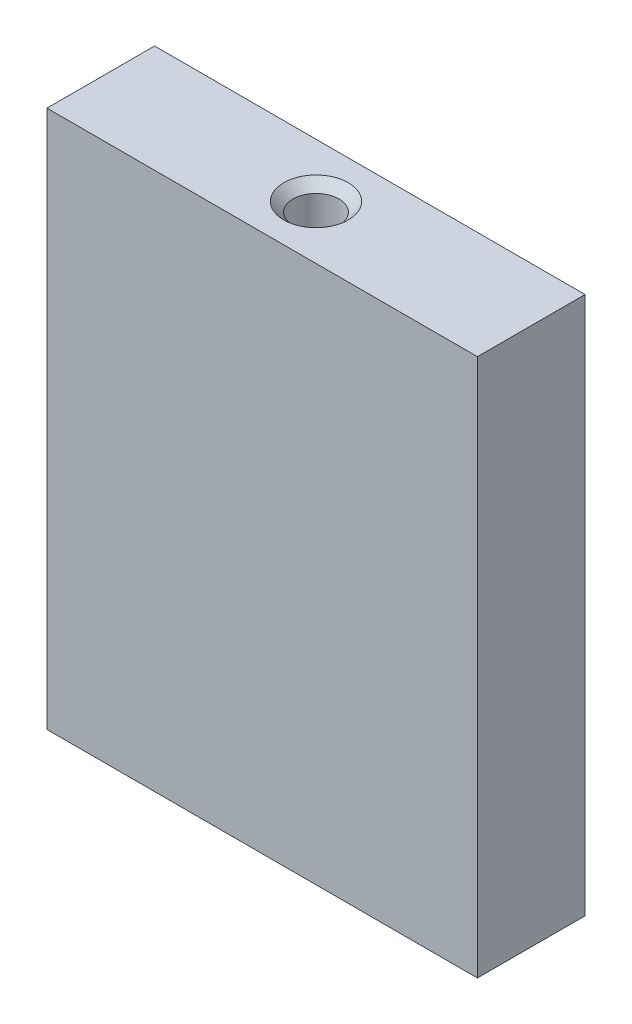
ISO-10303-21;
HEADER;
FILE_DESCRIPTION(('STEP AP214'),'2;1');
FILE_NAME('part.step','',(''),(''),'','','');
FILE_SCHEMA(('AUTOMOTIVE_DESIGN { 1 0 10303 214 1 1 1 1 }'));
ENDSEC;
DATA;
#1=APPLICATION_CONTEXT('core data for automotive mechanical design processes');
#2=APPLICATION_PROTOCOL_DEFINITION('international standard','automotive_design',2000,#1);
#3=PRODUCT_CONTEXT('',#1,'mechanical');
#4=PRODUCT('Part','Part','',(#3));
#5=PRODUCT_RELATED_PRODUCT_CATEGORY('part','',(#4));
#6=PRODUCT_DEFINITION_FORMATION('','',#4);
#7=PRODUCT_DEFINITION_CONTEXT('part definition',#1,'design');
#8=PRODUCT_DEFINITION('design','',#6,#7);
#9=PRODUCT_DEFINITION_SHAPE('','',#8);
#10=(LENGTH_UNIT() NAMED_UNIT(*) SI_UNIT(.MILLI.,.METRE.));
#11=(NAMED_UNIT(*) PLANE_ANGLE_UNIT() SI_UNIT($,.RADIAN.));
#12=(NAMED_UNIT(*) SI_UNIT($,.STERADIAN.) SOLID_ANGLE_UNIT());
#13=UNCERTAINTY_MEASURE_WITH_UNIT(LENGTH_MEASURE(1.E-05),#10,'distance_accuracy_value','');
#14=(GEOMETRIC_REPRESENTATION_CONTEXT(3) GLOBAL_UNCERTAINTY_ASSIGNED_CONTEXT((#13)) GLOBAL_UNIT_ASSIGNED_CONTEXT((#10,
#11,#12)) REPRESENTATION_CONTEXT('',''));
#15=CARTESIAN_POINT('',(0.,0.,0.));
#16=DIRECTION('',(0.,0.,1.));
#17=DIRECTION('',(1.,0.,0.));
#18=AXIS2_PLACEMENT_3D('',#15,#16,#17);
#19=CARTESIAN_POINT('',(25.4,31.75,6.35));
#20=DIRECTION('',(-1.,0.,0.));
#21=DIRECTION('',(0.,0.,1.));
#22=AXIS2_PLACEMENT_3D('',#19,#20,#21);
#23=PLANE('',#22);
#24=DIRECTION('',(0.,0.,-1.));
#25=VECTOR('',#24,1.);
#26=CARTESIAN_POINT('',(25.4,-31.75,6.35));
#27=LINE('',#26,#25);
#28=CARTESIAN_POINT('',(25.4,-31.75,6.35));
#29=VERTEX_POINT('',#28);
#30=CARTESIAN_POINT('',(25.4,-31.75,-6.35));
#31=VERTEX_POINT('',#30);
#32=EDGE_CURVE('E121',#29,#31,#27,.T.);
#33=ORIENTED_EDGE('',*,*,#32,.T.);
#34=DIRECTION('',(0.,-1.,0.));
#35=VECTOR('',#34,1.);
#36=CARTESIAN_POINT('',(25.4,31.75,-6.35));
#37=LINE('',#36,#35);
#38=CARTESIAN_POINT('',(25.4,31.75,-6.35));
#39=VERTEX_POINT('',#38);
#40=EDGE_CURVE('E11',#39,#31,#37,.T.);
#41=ORIENTED_EDGE('',*,*,#40,.F.);
#42=DIRECTION('',(0.,0.,-1.));
#43=VECTOR('',#42,1.);
#44=CARTESIAN_POINT('',(25.4,31.75,6.35));
#45=LINE('',#44,#43);
#46=CARTESIAN_POINT('',(25.4,31.75,6.35));
#47=VERTEX_POINT('',#46);
#48=EDGE_CURVE('E122',#47,#39,#45,.T.);
#49=ORIENTED_EDGE('',*,*,#48,.F.);
#50=DIRECTION('',(0.,-1.,0.));
#51=VECTOR('',#50,1.);
#52=CARTESIAN_POINT('',(25.4,31.75,6.35));
#53=LINE('',#52,#51);
#54=EDGE_CURVE('E128',#47,#29,#53,.T.);
#55=ORIENTED_EDGE('',*,*,#54,.T.);
#56=EDGE_LOOP('',(#33,#41,#49,#55));
#57=FACE_BOUND('',#56,.T.);
#58=ADVANCED_FACE('F41',(#57),#23,.F.);
#59=CARTESIAN_POINT('',(-25.4,31.75,-6.35));
#60=DIRECTION('',(0.,0.,1.));
#61=DIRECTION('',(1.,0.,0.));
#62=AXIS2_PLACEMENT_3D('',#59,#60,#61);
#63=PLANE('',#62);
#64=DIRECTION('',(-1.,0.,0.));
#65=VECTOR('',#64,1.);
#66=CARTESIAN_POINT('',(-25.4,-31.75,-6.35));
#67=LINE('',#66,#65);
#68=CARTESIAN_POINT('',(-25.4,-31.75,-6.35));
#69=VERTEX_POINT('',#68);
#70=EDGE_CURVE('E131',#31,#69,#67,.T.);
#71=ORIENTED_EDGE('',*,*,#70,.T.);
#72=DIRECTION('',(0.,-1.,0.));
#73=VECTOR('',#72,1.);
#74=CARTESIAN_POINT('',(-25.4,31.75,-6.35));
#75=LINE('',#74,#73);
#76=CARTESIAN_POINT('',(-25.4,31.75,-6.35));
#77=VERTEX_POINT('',#76);
#78=EDGE_CURVE('E49',#77,#69,#75,.T.);
#79=ORIENTED_EDGE('',*,*,#78,.F.);
#80=DIRECTION('',(-1.,0.,0.));
#81=VECTOR('',#80,1.);
#82=CARTESIAN_POINT('',(-25.4,31.75,-6.35));
#83=LINE('',#82,#81);
#84=EDGE_CURVE('E88',#39,#77,#83,.T.);
#85=ORIENTED_EDGE('',*,*,#84,.F.);
#86=ORIENTED_EDGE('',*,*,#40,.T.);
#87=EDGE_LOOP('',(#71,#79,#85,#86));
#88=FACE_BOUND('',#87,.T.);
#89=ADVANCED_FACE('F155',(#88),#63,.F.);
#90=CARTESIAN_POINT('',(-25.4,31.75,6.35));
#91=DIRECTION('',(1.,0.,0.));
#92=DIRECTION('',(0.,0.,-1.));
#93=AXIS2_PLACEMENT_3D('',#90,#91,#92);
#94=PLANE('',#93);
#95=DIRECTION('',(0.,0.,1.));
#96=VECTOR('',#95,1.);
#97=CARTESIAN_POINT('',(-25.4,-31.75,6.35));
#98=LINE('',#97,#96);
#99=CARTESIAN_POINT('',(-25.4,-31.75,6.35));
#100=VERTEX_POINT('',#99);
#101=EDGE_CURVE('E75',#69,#100,#98,.T.);
#102=ORIENTED_EDGE('',*,*,#101,.T.);
#103=DIRECTION('',(0.,-1.,0.));
#104=VECTOR('',#103,1.);
#105=CARTESIAN_POINT('',(-25.4,31.75,6.35));
#106=LINE('',#105,#104);
#107=CARTESIAN_POINT('',(-25.4,31.75,6.35));
#108=VERTEX_POINT('',#107);
#109=EDGE_CURVE('E136',#108,#100,#106,.T.);
#110=ORIENTED_EDGE('',*,*,#109,.F.);
#111=DIRECTION('',(0.,0.,1.));
#112=VECTOR('',#111,1.);
#113=CARTESIAN_POINT('',(-25.4,31.75,6.35));
#114=LINE('',#113,#112);
#115=EDGE_CURVE('E125',#77,#108,#114,.T.);
#116=ORIENTED_EDGE('',*,*,#115,.F.);
#117=ORIENTED_EDGE('',*,*,#78,.T.);
#118=EDGE_LOOP('',(#102,#110,#116,#117));
#119=FACE_BOUND('',#118,.T.);
#120=ADVANCED_FACE('F138',(#119),#94,.F.);
#121=CARTESIAN_POINT('',(-25.4,31.75,6.35));
#122=DIRECTION('',(0.,0.,-1.));
#123=DIRECTION('',(-1.,0.,0.));
#124=AXIS2_PLACEMENT_3D('',#121,#122,#123);
#125=PLANE('',#124);
#126=DIRECTION('',(1.,0.,0.));
#127=VECTOR('',#126,1.);
#128=CARTESIAN_POINT('',(-25.4,-31.75,6.35));
#129=LINE('',#128,#127);
#130=EDGE_CURVE('E81',#100,#29,#129,.T.);
#131=ORIENTED_EDGE('',*,*,#130,.T.);
#132=ORIENTED_EDGE('',*,*,#54,.F.);
#133=DIRECTION('',(1.,0.,0.));
#134=VECTOR('',#133,1.);
#135=CARTESIAN_POINT('',(-25.4,31.75,6.35));
#136=LINE('',#135,#134);
#137=EDGE_CURVE('E57',#108,#47,#136,.T.);
#138=ORIENTED_EDGE('',*,*,#137,.F.);
#139=ORIENTED_EDGE('',*,*,#109,.T.);
#140=EDGE_LOOP('',(#131,#132,#138,#139));
#141=FACE_BOUND('',#140,.T.);
#142=ADVANCED_FACE('F145',(#141),#125,.F.);
#143=CARTESIAN_POINT('',(0.,31.75,0.));
#144=DIRECTION('',(0.,-1.,0.));
#145=DIRECTION('',(0.,0.,-1.));
#146=AXIS2_PLACEMENT_3D('',#143,#144,#145);
#147=PLANE('',#146);
#148=CARTESIAN_POINT('',(0.,31.75,0.));
#149=DIRECTION('',(0.,1.,0.));
#150=DIRECTION('',(0.,0.,1.));
#151=AXIS2_PLACEMENT_3D('',#148,#149,#150);
#152=CIRCLE('',#151,3.81);
#153=CARTESIAN_POINT('',(0.,31.75,3.81));
#154=VERTEX_POINT('',#153);
#155=EDGE_CURVE('E105',#154,#154,#152,.T.);
#156=ORIENTED_EDGE('',*,*,#155,.F.);
#157=EDGE_LOOP('',(#156));
#158=FACE_BOUND('',#157,.T.);
#159=ORIENTED_EDGE('',*,*,#48,.T.);
#160=ORIENTED_EDGE('',*,*,#84,.T.);
#161=ORIENTED_EDGE('',*,*,#115,.T.);
#162=ORIENTED_EDGE('',*,*,#137,.T.);
#163=EDGE_LOOP('',(#159,#160,#161,#162));
#164=FACE_BOUND('',#163,.T.);
#165=ADVANCED_FACE('F147',(#158,#164),#147,.F.);
#166=CARTESIAN_POINT('',(0.,-31.75,0.));
#167=DIRECTION('',(0.,-1.,0.));
#168=DIRECTION('',(0.,0.,-1.));
#169=AXIS2_PLACEMENT_3D('',#166,#167,#168);
#170=PLANE('',#169);
#171=CARTESIAN_POINT('',(0.,-31.75,0.));
#172=DIRECTION('',(0.,-1.,0.));
#173=DIRECTION('',(0.,0.,-1.));
#174=AXIS2_PLACEMENT_3D('',#171,#172,#173);
#175=CIRCLE('',#174,3.81);
#176=CARTESIAN_POINT('',(0.,-31.75,-3.81));
#177=VERTEX_POINT('',#176);
#178=EDGE_CURVE('E112',#177,#177,#175,.T.);
#179=ORIENTED_EDGE('',*,*,#178,.F.);
#180=EDGE_LOOP('',(#179));
#181=FACE_BOUND('',#180,.T.);
#182=ORIENTED_EDGE('',*,*,#32,.F.);
#183=ORIENTED_EDGE('',*,*,#130,.F.);
#184=ORIENTED_EDGE('',*,*,#101,.F.);
#185=ORIENTED_EDGE('',*,*,#70,.F.);
#186=EDGE_LOOP('',(#182,#183,#184,#185));
#187=FACE_BOUND('',#186,.T.);
#188=ADVANCED_FACE('F141',(#181,#187),#170,.T.);
#189=CARTESIAN_POINT('',(0.,25.4,0.));
#190=DIRECTION('',(0.,1.,0.));
#191=DIRECTION('',(0.,0.,1.));
#192=AXIS2_PLACEMENT_3D('',#189,#190,#191);
#193=CONICAL_SURFACE('',#192,2.7051,1.02974425867665);
#194=CARTESIAN_POINT('',(0.,23.7746119394685,0.));
#195=VERTEX_POINT('',#194);
#196=VERTEX_LOOP('',#195);
#197=FACE_BOUND('',#196,.T.);
#198=CARTESIAN_POINT('',(0.,25.4,0.));
#199=DIRECTION('',(0.,1.,0.));
#200=DIRECTION('',(0.,0.,1.));
#201=AXIS2_PLACEMENT_3D('',#198,#199,#200);
#202=CIRCLE('',#201,2.7051);
#203=CARTESIAN_POINT('',(0.,25.4,2.7051));
#204=VERTEX_POINT('',#203);
#205=EDGE_CURVE('E118',#204,#204,#202,.T.);
#206=ORIENTED_EDGE('',*,*,#205,.T.);
#207=EDGE_LOOP('',(#206));
#208=FACE_BOUND('',#207,.T.);
#209=ADVANCED_FACE('F190',(#197,#208),#193,.F.);
#210=CARTESIAN_POINT('',(0.,31.75,0.));
#211=DIRECTION('',(0.,1.,0.));
#212=DIRECTION('',(0.,0.,1.));
#213=AXIS2_PLACEMENT_3D('',#210,#211,#212);
#214=CYLINDRICAL_SURFACE('',#213,2.7051);
#215=ORIENTED_EDGE('',*,*,#205,.F.);
#216=EDGE_LOOP('',(#215));
#217=FACE_BOUND('',#216,.T.);
#218=CARTESIAN_POINT('',(0.,30.6451,0.));
#219=DIRECTION('',(0.,1.,0.));
#220=DIRECTION('',(0.,0.,1.));
#221=AXIS2_PLACEMENT_3D('',#218,#219,#220);
#222=CIRCLE('',#221,2.7051);
#223=CARTESIAN_POINT('',(0.,30.6451,2.7051));
#224=VERTEX_POINT('',#223);
#225=EDGE_CURVE('E109',#224,#224,#222,.T.);
#226=ORIENTED_EDGE('',*,*,#225,.T.);
#227=EDGE_LOOP('',(#226));
#228=FACE_BOUND('',#227,.T.);
#229=ADVANCED_FACE('F195',(#217,#228),#214,.F.);
#230=CARTESIAN_POINT('',(0.,31.75,0.));
#231=DIRECTION('',(0.,1.,0.));
#232=DIRECTION('',(0.,0.,1.));
#233=AXIS2_PLACEMENT_3D('',#230,#231,#232);
#234=CONICAL_SURFACE('',#233,3.81,0.78539816339745);
#235=ORIENTED_EDGE('',*,*,#225,.F.);
#236=EDGE_LOOP('',(#235));
#237=FACE_BOUND('',#236,.T.);
#238=ORIENTED_EDGE('',*,*,#155,.T.);
#239=EDGE_LOOP('',(#238));
#240=FACE_BOUND('',#239,.T.);
#241=ADVANCED_FACE('F99',(#237,#240),#234,.F.);
#242=CARTESIAN_POINT('',(0.,-25.4,0.));
#243=DIRECTION('',(0.,-1.,0.));
#244=DIRECTION('',(0.,0.,-1.));
#245=AXIS2_PLACEMENT_3D('',#242,#243,#244);
#246=CONICAL_SURFACE('',#245,2.7051,1.02974425867665);
#247=CARTESIAN_POINT('',(0.,-23.7746119394685,0.));
#248=VERTEX_POINT('',#247);
#249=VERTEX_LOOP('',#248);
#250=FACE_BOUND('',#249,.T.);
#251=CARTESIAN_POINT('',(0.,-25.4,0.));
#252=DIRECTION('',(0.,-1.,0.));
#253=DIRECTION('',(0.,0.,-1.));
#254=AXIS2_PLACEMENT_3D('',#251,#252,#253);
#255=CIRCLE('',#254,2.7051);
#256=CARTESIAN_POINT('',(0.,-25.4,-2.7051));
#257=VERTEX_POINT('',#256);
#258=EDGE_CURVE('E103',#257,#257,#255,.T.);
#259=ORIENTED_EDGE('',*,*,#258,.T.);
#260=EDGE_LOOP('',(#259));
#261=FACE_BOUND('',#260,.T.);
#262=ADVANCED_FACE('F95',(#250,#261),#246,.F.);
#263=CARTESIAN_POINT('',(0.,-31.75,0.));
#264=DIRECTION('',(0.,-1.,0.));
#265=DIRECTION('',(0.,0.,-1.));
#266=AXIS2_PLACEMENT_3D('',#263,#264,#265);
#267=CYLINDRICAL_SURFACE('',#266,2.7051);
#268=ORIENTED_EDGE('',*,*,#258,.F.);
#269=EDGE_LOOP('',(#268));
#270=FACE_BOUND('',#269,.T.);
#271=CARTESIAN_POINT('',(0.,-30.6451,0.));
#272=DIRECTION('',(0.,-1.,0.));
#273=DIRECTION('',(0.,0.,-1.));
#274=AXIS2_PLACEMENT_3D('',#271,#272,#273);
#275=CIRCLE('',#274,2.7051);
#276=CARTESIAN_POINT('',(0.,-30.6451,-2.7051));
#277=VERTEX_POINT('',#276);
#278=EDGE_CURVE('E106',#277,#277,#275,.T.);
#279=ORIENTED_EDGE('',*,*,#278,.T.);
#280=EDGE_LOOP('',(#279));
#281=FACE_BOUND('',#280,.T.);
#282=ADVANCED_FACE('F98',(#270,#281),#267,.F.);
#283=CARTESIAN_POINT('',(0.,-31.75,0.));
#284=DIRECTION('',(0.,-1.,0.));
#285=DIRECTION('',(0.,0.,-1.));
#286=AXIS2_PLACEMENT_3D('',#283,#284,#285);
#287=CONICAL_SURFACE('',#286,3.81,0.78539816339745);
#288=ORIENTED_EDGE('',*,*,#278,.F.);
#289=EDGE_LOOP('',(#288));
#290=FACE_BOUND('',#289,.T.);
#291=ORIENTED_EDGE('',*,*,#178,.T.);
#292=EDGE_LOOP('',(#291));
#293=FACE_BOUND('',#292,.T.);
#294=ADVANCED_FACE('F247',(#290,#293),#287,.F.);
#295=CLOSED_SHELL('',(#58,#89,#120,#142,#165,#188,#209,#229,#241,#262,#282,#294));
#296=MANIFOLD_SOLID_BREP('B2',#295);
#297=ADVANCED_BREP_SHAPE_REPRESENTATION('',(#18,#296),#14);
#298=SHAPE_DEFINITION_REPRESENTATION(#9,#297);
ENDSEC;
END-ISO-10303-21;
